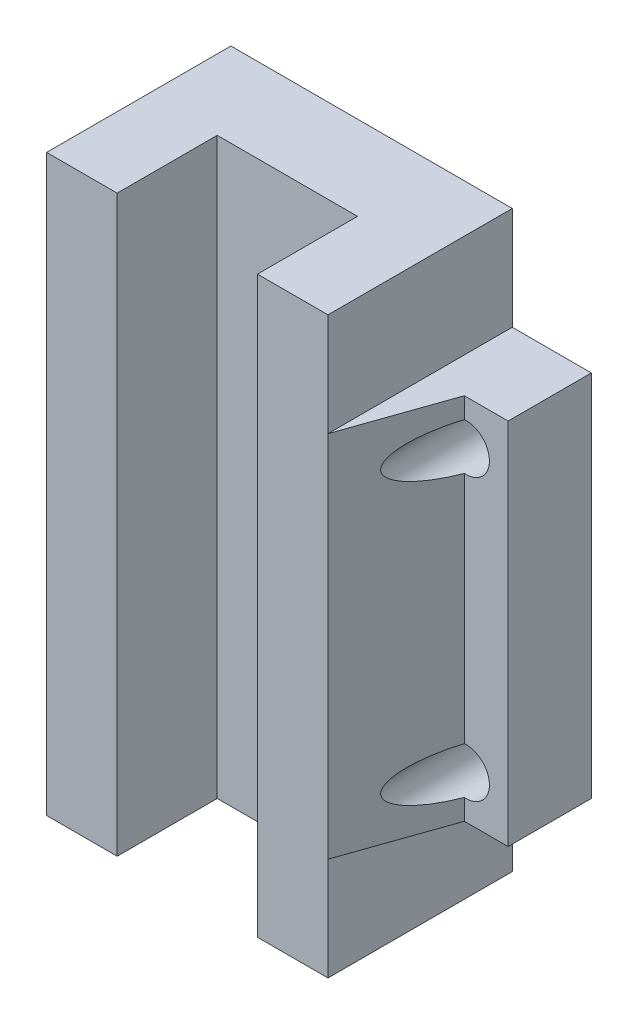
ISO-10303-21;
HEADER;
FILE_DESCRIPTION(('STEP AP214'),'2;1');
FILE_NAME('part.step','',(''),(''),'','','');
FILE_SCHEMA(('AUTOMOTIVE_DESIGN { 1 0 10303 214 1 1 1 1 }'));
ENDSEC;
DATA;
#1=APPLICATION_CONTEXT('core data for automotive mechanical design processes');
#2=APPLICATION_PROTOCOL_DEFINITION('international standard','automotive_design',2000,#1);
#3=PRODUCT_CONTEXT('',#1,'mechanical');
#4=PRODUCT('Part','Part','',(#3));
#5=PRODUCT_RELATED_PRODUCT_CATEGORY('part','',(#4));
#6=PRODUCT_DEFINITION_FORMATION('','',#4);
#7=PRODUCT_DEFINITION_CONTEXT('part definition',#1,'design');
#8=PRODUCT_DEFINITION('design','',#6,#7);
#9=PRODUCT_DEFINITION_SHAPE('','',#8);
#10=(LENGTH_UNIT() NAMED_UNIT(*) SI_UNIT(.MILLI.,.METRE.));
#11=(NAMED_UNIT(*) PLANE_ANGLE_UNIT() SI_UNIT($,.RADIAN.));
#12=(NAMED_UNIT(*) SI_UNIT($,.STERADIAN.) SOLID_ANGLE_UNIT());
#13=UNCERTAINTY_MEASURE_WITH_UNIT(LENGTH_MEASURE(1.E-05),#10,'distance_accuracy_value','');
#14=(GEOMETRIC_REPRESENTATION_CONTEXT(3) GLOBAL_UNCERTAINTY_ASSIGNED_CONTEXT((#13)) GLOBAL_UNIT_ASSIGNED_CONTEXT((#10,
#11,#12)) REPRESENTATION_CONTEXT('',''));
#15=CARTESIAN_POINT('',(0.,0.,0.));
#16=DIRECTION('',(0.,0.,1.));
#17=DIRECTION('',(1.,0.,0.));
#18=AXIS2_PLACEMENT_3D('',#15,#16,#17);
#19=CARTESIAN_POINT('',(23.5,61.4,9.85));
#20=DIRECTION('',(0.,0.,-1.));
#21=DIRECTION('',(-1.,0.,0.));
#22=AXIS2_PLACEMENT_3D('',#19,#20,#21);
#23=PLANE('',#22);
#24=DIRECTION('',(1.,0.,0.));
#25=VECTOR('',#24,1.);
#26=CARTESIAN_POINT('',(23.5,0.,9.85));
#27=LINE('',#26,#25);
#28=CARTESIAN_POINT('',(-15.0406665450277,0.,9.85));
#29=VERTEX_POINT('',#28);
#30=CARTESIAN_POINT('',(-7.5,0.,9.85));
#31=VERTEX_POINT('',#30);
#32=EDGE_CURVE('E350',#29,#31,#27,.T.);
#33=ORIENTED_EDGE('',*,*,#32,.T.);
#34=DIRECTION('',(0.,1.,0.));
#35=VECTOR('',#34,1.);
#36=CARTESIAN_POINT('',(-7.5,61.4,9.85));
#37=LINE('',#36,#35);
#38=CARTESIAN_POINT('',(-7.5,61.4,9.85));
#39=VERTEX_POINT('',#38);
#40=EDGE_CURVE('E48',#31,#39,#37,.T.);
#41=ORIENTED_EDGE('',*,*,#40,.T.);
#42=DIRECTION('',(1.,0.,0.));
#43=VECTOR('',#42,1.);
#44=CARTESIAN_POINT('',(23.5,61.4,9.85));
#45=LINE('',#44,#43);
#46=CARTESIAN_POINT('',(-15.0406665450277,61.4,9.85));
#47=VERTEX_POINT('',#46);
#48=EDGE_CURVE('E342',#47,#39,#45,.T.);
#49=ORIENTED_EDGE('',*,*,#48,.F.);
#50=DIRECTION('',(0.,1.,0.));
#51=VECTOR('',#50,1.);
#52=CARTESIAN_POINT('',(-15.0406665450277,50.4,9.85));
#53=LINE('',#52,#51);
#54=CARTESIAN_POINT('',(-15.0406665450277,50.4,9.85));
#55=VERTEX_POINT('',#54);
#56=EDGE_CURVE('E293',#55,#47,#53,.T.);
#57=ORIENTED_EDGE('',*,*,#56,.F.);
#58=DIRECTION('',(0.,1.,0.));
#59=VECTOR('',#58,1.);
#60=CARTESIAN_POINT('',(-15.0406665450277,0.,9.85));
#61=LINE('',#60,#59);
#62=CARTESIAN_POINT('',(-15.0406665450277,11.,9.85));
#63=VERTEX_POINT('',#62);
#64=EDGE_CURVE('E324',#63,#55,#61,.T.);
#65=ORIENTED_EDGE('',*,*,#64,.F.);
#66=EDGE_CURVE('E320',#29,#63,#61,.T.);
#67=ORIENTED_EDGE('',*,*,#66,.F.);
#68=EDGE_LOOP('',(#33,#41,#49,#57,#65,#67));
#69=FACE_BOUND('',#68,.T.);
#70=ADVANCED_FACE('F40',(#69),#23,.F.);
#71=CARTESIAN_POINT('',(23.5,61.4,-9.85));
#72=DIRECTION('',(0.,0.,1.));
#73=DIRECTION('',(1.,0.,0.));
#74=AXIS2_PLACEMENT_3D('',#71,#72,#73);
#75=PLANE('',#74);
#76=CARTESIAN_POINT('',(19.,45.7,-9.85));
#77=DIRECTION('',(0.,0.,-1.));
#78=DIRECTION('',(-1.,0.,0.));
#79=AXIS2_PLACEMENT_3D('',#76,#77,#78);
#80=CIRCLE('',#79,2.5);
#81=CARTESIAN_POINT('',(16.5,45.7,-9.85));
#82=VERTEX_POINT('',#81);
#83=EDGE_CURVE('E217',#82,#82,#80,.T.);
#84=ORIENTED_EDGE('',*,*,#83,.F.);
#85=EDGE_LOOP('',(#84));
#86=FACE_BOUND('',#85,.T.);
#87=CARTESIAN_POINT('',(19.,15.7,-9.85));
#88=DIRECTION('',(0.,0.,-1.));
#89=DIRECTION('',(-1.,0.,0.));
#90=AXIS2_PLACEMENT_3D('',#87,#88,#89);
#91=CIRCLE('',#90,2.5);
#92=CARTESIAN_POINT('',(16.5,15.7,-9.85));
#93=VERTEX_POINT('',#92);
#94=EDGE_CURVE('E221',#93,#93,#91,.T.);
#95=ORIENTED_EDGE('',*,*,#94,.F.);
#96=EDGE_LOOP('',(#95));
#97=FACE_BOUND('',#96,.T.);
#98=DIRECTION('',(0.,-1.,0.));
#99=VECTOR('',#98,1.);
#100=CARTESIAN_POINT('',(-15.0406665450277,11.,-9.85));
#101=LINE('',#100,#99);
#102=CARTESIAN_POINT('',(-15.0406665450277,11.,-9.85));
#103=VERTEX_POINT('',#102);
#104=CARTESIAN_POINT('',(-15.0406665450277,0.,-9.85));
#105=VERTEX_POINT('',#104);
#106=EDGE_CURVE('E255',#103,#105,#101,.T.);
#107=ORIENTED_EDGE('',*,*,#106,.F.);
#108=DIRECTION('',(-1.,0.,0.));
#109=VECTOR('',#108,1.);
#110=CARTESIAN_POINT('',(0.,11.,-9.85));
#111=LINE('',#110,#109);
#112=CARTESIAN_POINT('',(-23.5,11.,-9.85));
#113=VERTEX_POINT('',#112);
#114=EDGE_CURVE('E250',#103,#113,#111,.T.);
#115=ORIENTED_EDGE('',*,*,#114,.T.);
#116=DIRECTION('',(0.,-1.,0.));
#117=VECTOR('',#116,1.);
#118=CARTESIAN_POINT('',(-23.5,61.4,-9.85));
#119=LINE('',#118,#117);
#120=CARTESIAN_POINT('',(-23.5,50.4,-9.85));
#121=VERTEX_POINT('',#120);
#122=EDGE_CURVE('E349',#121,#113,#119,.T.);
#123=ORIENTED_EDGE('',*,*,#122,.F.);
#124=DIRECTION('',(-1.,0.,0.));
#125=VECTOR('',#124,1.);
#126=CARTESIAN_POINT('',(0.,50.4,-9.85));
#127=LINE('',#126,#125);
#128=CARTESIAN_POINT('',(-15.0406665450277,50.4,-9.85));
#129=VERTEX_POINT('',#128);
#130=EDGE_CURVE('E285',#129,#121,#127,.T.);
#131=ORIENTED_EDGE('',*,*,#130,.F.);
#132=DIRECTION('',(0.,1.,0.));
#133=VECTOR('',#132,1.);
#134=CARTESIAN_POINT('',(-15.0406665450277,50.4,-9.85));
#135=LINE('',#134,#133);
#136=CARTESIAN_POINT('',(-15.0406665450277,61.4,-9.85));
#137=VERTEX_POINT('',#136);
#138=EDGE_CURVE('E296',#129,#137,#135,.T.);
#139=ORIENTED_EDGE('',*,*,#138,.T.);
#140=DIRECTION('',(-1.,0.,0.));
#141=VECTOR('',#140,1.);
#142=CARTESIAN_POINT('',(23.5,61.4,-9.85));
#143=LINE('',#142,#141);
#144=CARTESIAN_POINT('',(15.0406665450277,61.4,-9.85));
#145=VERTEX_POINT('',#144);
#146=EDGE_CURVE('E345',#145,#137,#143,.T.);
#147=ORIENTED_EDGE('',*,*,#146,.F.);
#148=DIRECTION('',(0.,1.,0.));
#149=VECTOR('',#148,1.);
#150=CARTESIAN_POINT('',(15.0406665450277,50.4,-9.85));
#151=LINE('',#150,#149);
#152=CARTESIAN_POINT('',(15.0406665450277,50.4,-9.85));
#153=VERTEX_POINT('',#152);
#154=EDGE_CURVE('E295',#153,#145,#151,.T.);
#155=ORIENTED_EDGE('',*,*,#154,.F.);
#156=DIRECTION('',(-1.,0.,0.));
#157=VECTOR('',#156,1.);
#158=CARTESIAN_POINT('',(0.,50.4,-9.85));
#159=LINE('',#158,#157);
#160=CARTESIAN_POINT('',(23.5,50.4,-9.85));
#161=VERTEX_POINT('',#160);
#162=EDGE_CURVE('E311',#161,#153,#159,.T.);
#163=ORIENTED_EDGE('',*,*,#162,.F.);
#164=DIRECTION('',(0.,-1.,0.));
#165=VECTOR('',#164,1.);
#166=CARTESIAN_POINT('',(23.5,61.4,-9.85));
#167=LINE('',#166,#165);
#168=CARTESIAN_POINT('',(23.5,11.,-9.85));
#169=VERTEX_POINT('',#168);
#170=EDGE_CURVE('E357',#161,#169,#167,.T.);
#171=ORIENTED_EDGE('',*,*,#170,.T.);
#172=DIRECTION('',(-1.,0.,0.));
#173=VECTOR('',#172,1.);
#174=CARTESIAN_POINT('',(0.,11.,-9.85));
#175=LINE('',#174,#173);
#176=CARTESIAN_POINT('',(15.0406665450277,11.,-9.85));
#177=VERTEX_POINT('',#176);
#178=EDGE_CURVE('E264',#169,#177,#175,.T.);
#179=ORIENTED_EDGE('',*,*,#178,.T.);
#180=DIRECTION('',(0.,-1.,0.));
#181=VECTOR('',#180,1.);
#182=CARTESIAN_POINT('',(15.0406665450277,11.,-9.85));
#183=LINE('',#182,#181);
#184=CARTESIAN_POINT('',(15.0406665450277,0.,-9.85));
#185=VERTEX_POINT('',#184);
#186=EDGE_CURVE('E258',#177,#185,#183,.T.);
#187=ORIENTED_EDGE('',*,*,#186,.T.);
#188=DIRECTION('',(-1.,0.,0.));
#189=VECTOR('',#188,1.);
#190=CARTESIAN_POINT('',(23.5,0.,-9.85));
#191=LINE('',#190,#189);
#192=EDGE_CURVE('E352',#185,#105,#191,.T.);
#193=ORIENTED_EDGE('',*,*,#192,.T.);
#194=EDGE_LOOP('',(#107,#115,#123,#131,#139,#147,#155,#163,#171,#179,#187,#193));
#195=FACE_BOUND('',#194,.T.);
#196=CARTESIAN_POINT('',(-19.,15.7,-9.85));
#197=DIRECTION('',(0.,0.,-1.));
#198=DIRECTION('',(-1.,0.,0.));
#199=AXIS2_PLACEMENT_3D('',#196,#197,#198);
#200=CIRCLE('',#199,2.5);
#201=CARTESIAN_POINT('',(-21.5,15.7,-9.85));
#202=VERTEX_POINT('',#201);
#203=EDGE_CURVE('E218',#202,#202,#200,.F.);
#204=ORIENTED_EDGE('',*,*,#203,.T.);
#205=EDGE_LOOP('',(#204));
#206=FACE_BOUND('',#205,.T.);
#207=CARTESIAN_POINT('',(-19.,45.7,-9.85));
#208=DIRECTION('',(0.,0.,-1.));
#209=DIRECTION('',(-1.,0.,0.));
#210=AXIS2_PLACEMENT_3D('',#207,#208,#209);
#211=CIRCLE('',#210,2.50000000000001);
#212=CARTESIAN_POINT('',(-21.5,45.7,-9.85));
#213=VERTEX_POINT('',#212);
#214=EDGE_CURVE('E222',#213,#213,#211,.F.);
#215=ORIENTED_EDGE('',*,*,#214,.T.);
#216=EDGE_LOOP('',(#215));
#217=FACE_BOUND('',#216,.T.);
#218=ADVANCED_FACE('F386',(#86,#97,#195,#206,#217),#75,.F.);
#219=CARTESIAN_POINT('',(-23.5,61.4,9.85));
#220=DIRECTION('',(1.,0.,0.));
#221=DIRECTION('',(0.,0.,-1.));
#222=AXIS2_PLACEMENT_3D('',#219,#220,#221);
#223=PLANE('',#222);
#224=DIRECTION('',(0.,0.,1.));
#225=VECTOR('',#224,1.);
#226=CARTESIAN_POINT('',(-23.5,11.,0.));
#227=LINE('',#226,#225);
#228=CARTESIAN_POINT('',(-23.5,11.,-0.949999999999996));
#229=VERTEX_POINT('',#228);
#230=EDGE_CURVE('E247',#113,#229,#227,.T.);
#231=ORIENTED_EDGE('',*,*,#230,.T.);
#232=DIRECTION('',(0.,1.,0.));
#233=VECTOR('',#232,1.);
#234=CARTESIAN_POINT('',(-23.5,0.,-0.949999999999996));
#235=LINE('',#234,#233);
#236=CARTESIAN_POINT('',(-23.5,50.4,-0.949999999999996));
#237=VERTEX_POINT('',#236);
#238=EDGE_CURVE('E325',#229,#237,#235,.T.);
#239=ORIENTED_EDGE('',*,*,#238,.T.);
#240=DIRECTION('',(0.,0.,1.));
#241=VECTOR('',#240,1.);
#242=CARTESIAN_POINT('',(-23.5,50.4,0.));
#243=LINE('',#242,#241);
#244=EDGE_CURVE('E287',#121,#237,#243,.T.);
#245=ORIENTED_EDGE('',*,*,#244,.F.);
#246=ORIENTED_EDGE('',*,*,#122,.T.);
#247=EDGE_LOOP('',(#231,#239,#245,#246));
#248=FACE_BOUND('',#247,.T.);
#249=ADVANCED_FACE('F42',(#248),#223,.F.);
#250=CARTESIAN_POINT('',(23.5,61.4,9.85));
#251=DIRECTION('',(-1.,0.,0.));
#252=DIRECTION('',(0.,0.,1.));
#253=AXIS2_PLACEMENT_3D('',#250,#251,#252);
#254=PLANE('',#253);
#255=DIRECTION('',(0.,0.,-1.));
#256=VECTOR('',#255,1.);
#257=CARTESIAN_POINT('',(23.5,11.,0.));
#258=LINE('',#257,#256);
#259=CARTESIAN_POINT('',(23.5,11.,-0.950000000000001));
#260=VERTEX_POINT('',#259);
#261=EDGE_CURVE('E267',#260,#169,#258,.T.);
#262=ORIENTED_EDGE('',*,*,#261,.T.);
#263=ORIENTED_EDGE('',*,*,#170,.F.);
#264=DIRECTION('',(0.,0.,-1.));
#265=VECTOR('',#264,1.);
#266=CARTESIAN_POINT('',(23.5,50.4,0.));
#267=LINE('',#266,#265);
#268=CARTESIAN_POINT('',(23.5,50.4,-0.950000000000001));
#269=VERTEX_POINT('',#268);
#270=EDGE_CURVE('E309',#269,#161,#267,.T.);
#271=ORIENTED_EDGE('',*,*,#270,.F.);
#272=DIRECTION('',(0.,1.,0.));
#273=VECTOR('',#272,1.);
#274=CARTESIAN_POINT('',(23.5,0.,-0.950000000000001));
#275=LINE('',#274,#273);
#276=EDGE_CURVE('E299',#260,#269,#275,.T.);
#277=ORIENTED_EDGE('',*,*,#276,.F.);
#278=EDGE_LOOP('',(#262,#263,#271,#277));
#279=FACE_BOUND('',#278,.T.);
#280=ADVANCED_FACE('F436',(#279),#254,.F.);
#281=CARTESIAN_POINT('',(16.4706870117693,0.,5.76297701154337));
#282=DIRECTION('',(-0.943889862378545,0.,-0.330260393778926));
#283=DIRECTION('',(-0.330260393778926,0.,0.943889862378545));
#284=AXIS2_PLACEMENT_3D('',#281,#282,#283);
#285=PLANE('',#284);
#286=DIRECTION('',(0.,1.,0.));
#287=VECTOR('',#286,1.);
#288=CARTESIAN_POINT('',(18.8195102374732,0.,-0.950000000000001));
#289=LINE('',#288,#287);
#290=CARTESIAN_POINT('',(18.8195102374732,18.1934761770715,-0.95));
#291=VERTEX_POINT('',#290);
#292=CARTESIAN_POINT('',(18.8195102374732,43.2065238229285,-0.95));
#293=VERTEX_POINT('',#292);
#294=EDGE_CURVE('E339',#291,#293,#289,.T.);
#295=ORIENTED_EDGE('',*,*,#294,.T.);
#296=CARTESIAN_POINT('',(19.,45.7,-1.46584283287132));
#297=DIRECTION('',(-0.943889862378545,0.,-0.330260393778926));
#298=DIRECTION('',(0.330260393778926,0.,-0.943889862378545));
#299=AXIS2_PLACEMENT_3D('',#296,#297,#298);
#300=ELLIPSE('',#299,7.56978447035183,2.5);
#301=CARTESIAN_POINT('',(18.8195102374732,48.1934761770715,-0.95));
#302=VERTEX_POINT('',#301);
#303=EDGE_CURVE('E62',#293,#302,#300,.T.);
#304=ORIENTED_EDGE('',*,*,#303,.T.);
#305=CARTESIAN_POINT('',(18.8195102374732,50.4,-0.950000000000001));
#306=VERTEX_POINT('',#305);
#307=EDGE_CURVE('E340',#302,#306,#289,.T.);
#308=ORIENTED_EDGE('',*,*,#307,.T.);
#309=DIRECTION('',(-0.330260393778926,0.,0.943889862378545));
#310=VECTOR('',#309,1.);
#311=CARTESIAN_POINT('',(16.4706870117693,50.4,5.76297701154337));
#312=LINE('',#311,#310);
#313=CARTESIAN_POINT('',(15.0406665450277,50.4,9.85));
#314=VERTEX_POINT('',#313);
#315=EDGE_CURVE('E303',#306,#314,#312,.T.);
#316=ORIENTED_EDGE('',*,*,#315,.T.);
#317=DIRECTION('',(0.,1.,0.));
#318=VECTOR('',#317,1.);
#319=CARTESIAN_POINT('',(15.0406665450277,0.,9.85));
#320=LINE('',#319,#318);
#321=CARTESIAN_POINT('',(15.0406665450277,11.,9.85));
#322=VERTEX_POINT('',#321);
#323=EDGE_CURVE('E335',#322,#314,#320,.T.);
#324=ORIENTED_EDGE('',*,*,#323,.F.);
#325=DIRECTION('',(-0.330260393778926,0.,0.943889862378545));
#326=VECTOR('',#325,1.);
#327=CARTESIAN_POINT('',(16.4706870117693,11.,5.76297701154337));
#328=LINE('',#327,#326);
#329=CARTESIAN_POINT('',(18.8195102374732,11.,-0.950000000000001));
#330=VERTEX_POINT('',#329);
#331=EDGE_CURVE('E272',#330,#322,#328,.T.);
#332=ORIENTED_EDGE('',*,*,#331,.F.);
#333=CARTESIAN_POINT('',(18.8195102374732,13.2065238229285,-0.95));
#334=VERTEX_POINT('',#333);
#335=EDGE_CURVE('E336',#330,#334,#289,.T.);
#336=ORIENTED_EDGE('',*,*,#335,.T.);
#337=CARTESIAN_POINT('',(19.,15.7,-1.46584283287132));
#338=DIRECTION('',(-0.943889862378545,0.,-0.330260393778926));
#339=DIRECTION('',(0.330260393778926,0.,-0.943889862378545));
#340=AXIS2_PLACEMENT_3D('',#337,#338,#339);
#341=ELLIPSE('',#340,7.56978447035183,2.5);
#342=EDGE_CURVE('E235',#334,#291,#341,.T.);
#343=ORIENTED_EDGE('',*,*,#342,.T.);
#344=EDGE_LOOP('',(#295,#304,#308,#316,#324,#332,#336,#343));
#345=FACE_BOUND('',#344,.T.);
#346=ADVANCED_FACE('F419',(#345),#285,.F.);
#347=CARTESIAN_POINT('',(0.,0.,-0.949999999999997));
#348=DIRECTION('',(0.,0.,-1.));
#349=DIRECTION('',(-1.,0.,0.));
#350=AXIS2_PLACEMENT_3D('',#347,#348,#349);
#351=PLANE('',#350);
#352=ORIENTED_EDGE('',*,*,#307,.F.);
#353=CARTESIAN_POINT('',(19.,45.7,-0.95));
#354=DIRECTION('',(0.,0.,-1.));
#355=DIRECTION('',(-1.,0.,0.));
#356=AXIS2_PLACEMENT_3D('',#353,#354,#355);
#357=CIRCLE('',#356,2.5);
#358=EDGE_CURVE('E369',#302,#293,#357,.T.);
#359=ORIENTED_EDGE('',*,*,#358,.T.);
#360=ORIENTED_EDGE('',*,*,#294,.F.);
#361=CARTESIAN_POINT('',(19.,15.7,-0.95));
#362=DIRECTION('',(0.,0.,-1.));
#363=DIRECTION('',(-1.,0.,0.));
#364=AXIS2_PLACEMENT_3D('',#361,#362,#363);
#365=CIRCLE('',#364,2.5);
#366=EDGE_CURVE('E366',#291,#334,#365,.T.);
#367=ORIENTED_EDGE('',*,*,#366,.T.);
#368=ORIENTED_EDGE('',*,*,#335,.F.);
#369=DIRECTION('',(-1.,0.,0.));
#370=VECTOR('',#369,1.);
#371=CARTESIAN_POINT('',(0.,11.,-0.949999999999997));
#372=LINE('',#371,#370);
#373=EDGE_CURVE('E270',#260,#330,#372,.T.);
#374=ORIENTED_EDGE('',*,*,#373,.F.);
#375=ORIENTED_EDGE('',*,*,#276,.T.);
#376=DIRECTION('',(-1.,0.,0.));
#377=VECTOR('',#376,1.);
#378=CARTESIAN_POINT('',(0.,50.4,-0.949999999999997));
#379=LINE('',#378,#377);
#380=EDGE_CURVE('E306',#269,#306,#379,.T.);
#381=ORIENTED_EDGE('',*,*,#380,.T.);
#382=EDGE_LOOP('',(#352,#359,#360,#367,#368,#374,#375,#381));
#383=FACE_BOUND('',#382,.T.);
#384=ADVANCED_FACE('F440',(#383),#351,.F.);
#385=CARTESIAN_POINT('',(-16.4706870117693,0.,5.76297701154337));
#386=DIRECTION('',(-0.943889862378545,0.,0.330260393778927));
#387=DIRECTION('',(0.330260393778927,0.,0.943889862378545));
#388=AXIS2_PLACEMENT_3D('',#385,#386,#387);
#389=PLANE('',#388);
#390=DIRECTION('',(0.,1.,0.));
#391=VECTOR('',#390,1.);
#392=CARTESIAN_POINT('',(-18.8195102374732,0.,-0.949999999999996));
#393=LINE('',#392,#391);
#394=CARTESIAN_POINT('',(-18.8195102374732,48.1934761770715,-0.949999999999996));
#395=VERTEX_POINT('',#394);
#396=CARTESIAN_POINT('',(-18.8195102374732,50.4,-0.949999999999996));
#397=VERTEX_POINT('',#396);
#398=EDGE_CURVE('E331',#395,#397,#393,.T.);
#399=ORIENTED_EDGE('',*,*,#398,.F.);
#400=CARTESIAN_POINT('',(-19.,45.7,-1.46584283287134));
#401=DIRECTION('',(-0.943889862378545,0.,0.330260393778927));
#402=DIRECTION('',(-0.330260393778927,0.,-0.943889862378545));
#403=AXIS2_PLACEMENT_3D('',#400,#401,#402);
#404=ELLIPSE('',#403,7.56978447035185,2.50000000000001);
#405=CARTESIAN_POINT('',(-18.8195102374732,43.2065238229285,-0.949999999999996));
#406=VERTEX_POINT('',#405);
#407=EDGE_CURVE('E232',#395,#406,#404,.F.);
#408=ORIENTED_EDGE('',*,*,#407,.T.);
#409=CARTESIAN_POINT('',(-18.8195102374732,18.1934761770715,-0.949999999999996));
#410=VERTEX_POINT('',#409);
#411=EDGE_CURVE('E330',#410,#406,#393,.T.);
#412=ORIENTED_EDGE('',*,*,#411,.F.);
#413=CARTESIAN_POINT('',(-19.,15.7,-1.46584283287134));
#414=DIRECTION('',(-0.943889862378545,0.,0.330260393778927));
#415=DIRECTION('',(-0.330260393778927,0.,-0.943889862378545));
#416=AXIS2_PLACEMENT_3D('',#413,#414,#415);
#417=ELLIPSE('',#416,7.56978447035184,2.5);
#418=CARTESIAN_POINT('',(-18.8195102374732,13.2065238229285,-0.949999999999996));
#419=VERTEX_POINT('',#418);
#420=EDGE_CURVE('E229',#410,#419,#417,.F.);
#421=ORIENTED_EDGE('',*,*,#420,.T.);
#422=CARTESIAN_POINT('',(-18.8195102374732,11.,-0.949999999999996));
#423=VERTEX_POINT('',#422);
#424=EDGE_CURVE('E327',#423,#419,#393,.T.);
#425=ORIENTED_EDGE('',*,*,#424,.F.);
#426=DIRECTION('',(0.330260393778927,0.,0.943889862378545));
#427=VECTOR('',#426,1.);
#428=CARTESIAN_POINT('',(-16.4706870117693,11.,5.76297701154337));
#429=LINE('',#428,#427);
#430=EDGE_CURVE('E240',#423,#63,#429,.T.);
#431=ORIENTED_EDGE('',*,*,#430,.T.);
#432=ORIENTED_EDGE('',*,*,#64,.T.);
#433=DIRECTION('',(0.330260393778927,0.,0.943889862378545));
#434=VECTOR('',#433,1.);
#435=CARTESIAN_POINT('',(-16.4706870117693,50.4,5.76297701154337));
#436=LINE('',#435,#434);
#437=EDGE_CURVE('E278',#397,#55,#436,.T.);
#438=ORIENTED_EDGE('',*,*,#437,.F.);
#439=EDGE_LOOP('',(#399,#408,#412,#421,#425,#431,#432,#438));
#440=FACE_BOUND('',#439,.T.);
#441=ADVANCED_FACE('F403',(#440),#389,.T.);
#442=CARTESIAN_POINT('',(0.,0.,-0.949999999999996));
#443=DIRECTION('',(0.,0.,1.));
#444=DIRECTION('',(1.,0.,0.));
#445=AXIS2_PLACEMENT_3D('',#442,#443,#444);
#446=PLANE('',#445);
#447=ORIENTED_EDGE('',*,*,#411,.T.);
#448=CARTESIAN_POINT('',(-19.,45.7,-0.949999999999996));
#449=DIRECTION('',(0.,0.,1.));
#450=DIRECTION('',(1.,0.,0.));
#451=AXIS2_PLACEMENT_3D('',#448,#449,#450);
#452=CIRCLE('',#451,2.50000000000001);
#453=EDGE_CURVE('E363',#406,#395,#452,.F.);
#454=ORIENTED_EDGE('',*,*,#453,.T.);
#455=ORIENTED_EDGE('',*,*,#398,.T.);
#456=DIRECTION('',(1.,0.,0.));
#457=VECTOR('',#456,1.);
#458=CARTESIAN_POINT('',(0.,50.4,-0.949999999999996));
#459=LINE('',#458,#457);
#460=EDGE_CURVE('E290',#237,#397,#459,.T.);
#461=ORIENTED_EDGE('',*,*,#460,.F.);
#462=ORIENTED_EDGE('',*,*,#238,.F.);
#463=DIRECTION('',(1.,0.,0.));
#464=VECTOR('',#463,1.);
#465=CARTESIAN_POINT('',(0.,11.,-0.949999999999996));
#466=LINE('',#465,#464);
#467=EDGE_CURVE('E243',#229,#423,#466,.T.);
#468=ORIENTED_EDGE('',*,*,#467,.T.);
#469=ORIENTED_EDGE('',*,*,#424,.T.);
#470=CARTESIAN_POINT('',(-19.,15.7,-0.949999999999996));
#471=DIRECTION('',(0.,0.,1.));
#472=DIRECTION('',(1.,0.,0.));
#473=AXIS2_PLACEMENT_3D('',#470,#471,#472);
#474=CIRCLE('',#473,2.5);
#475=EDGE_CURVE('E360',#419,#410,#474,.F.);
#476=ORIENTED_EDGE('',*,*,#475,.T.);
#477=EDGE_LOOP('',(#447,#454,#455,#461,#462,#468,#469,#476));
#478=FACE_BOUND('',#477,.T.);
#479=ADVANCED_FACE('F398',(#478),#446,.T.);
#480=CARTESIAN_POINT('',(0.,0.,0.));
#481=DIRECTION('',(0.,1.,0.));
#482=DIRECTION('',(0.,0.,1.));
#483=AXIS2_PLACEMENT_3D('',#480,#481,#482);
#484=PLANE('',#483);
#485=DIRECTION('',(1.,0.,0.));
#486=VECTOR('',#485,1.);
#487=CARTESIAN_POINT('',(7.5,0.,-0.849999999999995));
#488=LINE('',#487,#486);
#489=CARTESIAN_POINT('',(-7.5,0.,-0.849999999999997));
#490=VERTEX_POINT('',#489);
#491=CARTESIAN_POINT('',(7.5,0.,-0.849999999999995));
#492=VERTEX_POINT('',#491);
#493=EDGE_CURVE('E193',#490,#492,#488,.T.);
#494=ORIENTED_EDGE('',*,*,#493,.F.);
#495=DIRECTION('',(0.,0.,-1.));
#496=VECTOR('',#495,1.);
#497=CARTESIAN_POINT('',(-7.5,0.,-0.849999999999997));
#498=LINE('',#497,#496);
#499=EDGE_CURVE('E200',#31,#490,#498,.T.);
#500=ORIENTED_EDGE('',*,*,#499,.F.);
#501=ORIENTED_EDGE('',*,*,#32,.F.);
#502=DIRECTION('',(0.,0.,-1.));
#503=VECTOR('',#502,1.);
#504=CARTESIAN_POINT('',(-15.0406665450277,0.,0.));
#505=LINE('',#504,#503);
#506=EDGE_CURVE('E244',#29,#105,#505,.T.);
#507=ORIENTED_EDGE('',*,*,#506,.T.);
#508=ORIENTED_EDGE('',*,*,#192,.F.);
#509=DIRECTION('',(0.,0.,-1.));
#510=VECTOR('',#509,1.);
#511=CARTESIAN_POINT('',(15.0406665450277,0.,0.));
#512=LINE('',#511,#510);
#513=CARTESIAN_POINT('',(15.0406665450277,0.,9.85));
#514=VERTEX_POINT('',#513);
#515=EDGE_CURVE('E239',#514,#185,#512,.T.);
#516=ORIENTED_EDGE('',*,*,#515,.F.);
#517=CARTESIAN_POINT('',(7.5,0.,9.85));
#518=VERTEX_POINT('',#517);
#519=EDGE_CURVE('E323',#518,#514,#27,.T.);
#520=ORIENTED_EDGE('',*,*,#519,.F.);
#521=DIRECTION('',(0.,0.,1.));
#522=VECTOR('',#521,1.);
#523=CARTESIAN_POINT('',(7.5,0.,-0.849999999999995));
#524=LINE('',#523,#522);
#525=EDGE_CURVE('E55',#492,#518,#524,.T.);
#526=ORIENTED_EDGE('',*,*,#525,.F.);
#527=EDGE_LOOP('',(#494,#500,#501,#507,#508,#516,#520,#526));
#528=FACE_BOUND('',#527,.T.);
#529=ADVANCED_FACE('F207',(#528),#484,.F.);
#530=CARTESIAN_POINT('',(0.,61.4,0.));
#531=DIRECTION('',(0.,1.,0.));
#532=DIRECTION('',(0.,0.,1.));
#533=AXIS2_PLACEMENT_3D('',#530,#531,#532);
#534=PLANE('',#533);
#535=DIRECTION('',(0.,0.,1.));
#536=VECTOR('',#535,1.);
#537=CARTESIAN_POINT('',(-7.5,61.4,0.));
#538=LINE('',#537,#536);
#539=CARTESIAN_POINT('',(-7.5,61.4,-0.849999999999997));
#540=VERTEX_POINT('',#539);
#541=EDGE_CURVE('E215',#540,#39,#538,.T.);
#542=ORIENTED_EDGE('',*,*,#541,.F.);
#543=DIRECTION('',(-1.,0.,0.));
#544=VECTOR('',#543,1.);
#545=CARTESIAN_POINT('',(0.,61.4,-0.849999999999996));
#546=LINE('',#545,#544);
#547=CARTESIAN_POINT('',(7.5,61.4,-0.849999999999995));
#548=VERTEX_POINT('',#547);
#549=EDGE_CURVE('E11',#548,#540,#546,.T.);
#550=ORIENTED_EDGE('',*,*,#549,.F.);
#551=DIRECTION('',(0.,0.,-1.));
#552=VECTOR('',#551,1.);
#553=CARTESIAN_POINT('',(7.5,61.4,0.));
#554=LINE('',#553,#552);
#555=CARTESIAN_POINT('',(7.5,61.4,9.85));
#556=VERTEX_POINT('',#555);
#557=EDGE_CURVE('E212',#556,#548,#554,.T.);
#558=ORIENTED_EDGE('',*,*,#557,.F.);
#559=CARTESIAN_POINT('',(15.0406665450277,61.4,9.85));
#560=VERTEX_POINT('',#559);
#561=EDGE_CURVE('E346',#556,#560,#45,.T.);
#562=ORIENTED_EDGE('',*,*,#561,.T.);
#563=DIRECTION('',(0.,0.,-1.));
#564=VECTOR('',#563,1.);
#565=CARTESIAN_POINT('',(15.0406665450277,61.4,0.));
#566=LINE('',#565,#564);
#567=EDGE_CURVE('E260',#560,#145,#566,.T.);
#568=ORIENTED_EDGE('',*,*,#567,.T.);
#569=ORIENTED_EDGE('',*,*,#146,.T.);
#570=DIRECTION('',(0.,0.,-1.));
#571=VECTOR('',#570,1.);
#572=CARTESIAN_POINT('',(-15.0406665450277,61.4,0.));
#573=LINE('',#572,#571);
#574=EDGE_CURVE('E282',#47,#137,#573,.T.);
#575=ORIENTED_EDGE('',*,*,#574,.F.);
#576=ORIENTED_EDGE('',*,*,#48,.T.);
#577=EDGE_LOOP('',(#542,#550,#558,#562,#568,#569,#575,#576));
#578=FACE_BOUND('',#577,.T.);
#579=ADVANCED_FACE('F378',(#578),#534,.T.);
#580=ORIENTED_EDGE('',*,*,#561,.F.);
#581=DIRECTION('',(0.,-1.,0.));
#582=VECTOR('',#581,1.);
#583=CARTESIAN_POINT('',(7.5,61.4,9.85));
#584=LINE('',#583,#582);
#585=EDGE_CURVE('E371',#556,#518,#584,.T.);
#586=ORIENTED_EDGE('',*,*,#585,.T.);
#587=ORIENTED_EDGE('',*,*,#519,.T.);
#588=EDGE_CURVE('E332',#514,#322,#320,.T.);
#589=ORIENTED_EDGE('',*,*,#588,.T.);
#590=ORIENTED_EDGE('',*,*,#323,.T.);
#591=DIRECTION('',(0.,1.,0.));
#592=VECTOR('',#591,1.);
#593=CARTESIAN_POINT('',(15.0406665450277,50.4,9.85));
#594=LINE('',#593,#592);
#595=EDGE_CURVE('E314',#314,#560,#594,.T.);
#596=ORIENTED_EDGE('',*,*,#595,.T.);
#597=EDGE_LOOP('',(#580,#586,#587,#589,#590,#596));
#598=FACE_BOUND('',#597,.T.);
#599=ADVANCED_FACE('F424',(#598),#23,.F.);
#600=CARTESIAN_POINT('',(-15.0406665450277,50.4,0.));
#601=DIRECTION('',(1.,0.,0.));
#602=DIRECTION('',(0.,0.,-1.));
#603=AXIS2_PLACEMENT_3D('',#600,#601,#602);
#604=PLANE('',#603);
#605=ORIENTED_EDGE('',*,*,#574,.T.);
#606=ORIENTED_EDGE('',*,*,#138,.F.);
#607=DIRECTION('',(0.,0.,-1.));
#608=VECTOR('',#607,1.);
#609=CARTESIAN_POINT('',(-15.0406665450277,50.4,0.));
#610=LINE('',#609,#608);
#611=EDGE_CURVE('E281',#55,#129,#610,.T.);
#612=ORIENTED_EDGE('',*,*,#611,.F.);
#613=ORIENTED_EDGE('',*,*,#56,.T.);
#614=EDGE_LOOP('',(#605,#606,#612,#613));
#615=FACE_BOUND('',#614,.T.);
#616=ADVANCED_FACE('F381',(#615),#604,.F.);
#617=CARTESIAN_POINT('',(0.,50.4,0.));
#618=DIRECTION('',(0.,1.,0.));
#619=DIRECTION('',(0.,0.,1.));
#620=AXIS2_PLACEMENT_3D('',#617,#618,#619);
#621=PLANE('',#620);
#622=ORIENTED_EDGE('',*,*,#437,.T.);
#623=ORIENTED_EDGE('',*,*,#611,.T.);
#624=ORIENTED_EDGE('',*,*,#130,.T.);
#625=ORIENTED_EDGE('',*,*,#244,.T.);
#626=ORIENTED_EDGE('',*,*,#460,.T.);
#627=EDGE_LOOP('',(#622,#623,#624,#625,#626));
#628=FACE_BOUND('',#627,.T.);
#629=ADVANCED_FACE('F392',(#628),#621,.T.);
#630=CARTESIAN_POINT('',(15.0406665450277,50.4,0.));
#631=DIRECTION('',(1.,0.,0.));
#632=DIRECTION('',(0.,0.,-1.));
#633=AXIS2_PLACEMENT_3D('',#630,#631,#632);
#634=PLANE('',#633);
#635=ORIENTED_EDGE('',*,*,#567,.F.);
#636=ORIENTED_EDGE('',*,*,#595,.F.);
#637=DIRECTION('',(0.,0.,-1.));
#638=VECTOR('',#637,1.);
#639=CARTESIAN_POINT('',(15.0406665450277,50.4,0.));
#640=LINE('',#639,#638);
#641=EDGE_CURVE('E301',#314,#153,#640,.T.);
#642=ORIENTED_EDGE('',*,*,#641,.T.);
#643=ORIENTED_EDGE('',*,*,#154,.T.);
#644=EDGE_LOOP('',(#635,#636,#642,#643));
#645=FACE_BOUND('',#644,.T.);
#646=ADVANCED_FACE('F429',(#645),#634,.T.);
#647=CARTESIAN_POINT('',(0.,50.4,0.));
#648=DIRECTION('',(0.,1.,0.));
#649=DIRECTION('',(0.,0.,1.));
#650=AXIS2_PLACEMENT_3D('',#647,#648,#649);
#651=PLANE('',#650);
#652=ORIENTED_EDGE('',*,*,#641,.F.);
#653=ORIENTED_EDGE('',*,*,#315,.F.);
#654=ORIENTED_EDGE('',*,*,#380,.F.);
#655=ORIENTED_EDGE('',*,*,#270,.T.);
#656=ORIENTED_EDGE('',*,*,#162,.T.);
#657=EDGE_LOOP('',(#652,#653,#654,#655,#656));
#658=FACE_BOUND('',#657,.T.);
#659=ADVANCED_FACE('F444',(#658),#651,.T.);
#660=CARTESIAN_POINT('',(15.0406665450277,11.,0.));
#661=DIRECTION('',(-1.,0.,0.));
#662=DIRECTION('',(0.,0.,1.));
#663=AXIS2_PLACEMENT_3D('',#660,#661,#662);
#664=PLANE('',#663);
#665=ORIENTED_EDGE('',*,*,#515,.T.);
#666=ORIENTED_EDGE('',*,*,#186,.F.);
#667=DIRECTION('',(0.,0.,-1.));
#668=VECTOR('',#667,1.);
#669=CARTESIAN_POINT('',(15.0406665450277,11.,0.));
#670=LINE('',#669,#668);
#671=EDGE_CURVE('E261',#322,#177,#670,.T.);
#672=ORIENTED_EDGE('',*,*,#671,.F.);
#673=ORIENTED_EDGE('',*,*,#588,.F.);
#674=EDGE_LOOP('',(#665,#666,#672,#673));
#675=FACE_BOUND('',#674,.T.);
#676=ADVANCED_FACE('F409',(#675),#664,.F.);
#677=CARTESIAN_POINT('',(0.,11.,0.));
#678=DIRECTION('',(0.,-1.,0.));
#679=DIRECTION('',(0.,0.,1.));
#680=AXIS2_PLACEMENT_3D('',#677,#678,#679);
#681=PLANE('',#680);
#682=ORIENTED_EDGE('',*,*,#671,.T.);
#683=ORIENTED_EDGE('',*,*,#178,.F.);
#684=ORIENTED_EDGE('',*,*,#261,.F.);
#685=ORIENTED_EDGE('',*,*,#373,.T.);
#686=ORIENTED_EDGE('',*,*,#331,.T.);
#687=EDGE_LOOP('',(#682,#683,#684,#685,#686));
#688=FACE_BOUND('',#687,.T.);
#689=ADVANCED_FACE('F412',(#688),#681,.T.);
#690=CARTESIAN_POINT('',(-15.0406665450277,11.,0.));
#691=DIRECTION('',(-1.,0.,0.));
#692=DIRECTION('',(0.,0.,1.));
#693=AXIS2_PLACEMENT_3D('',#690,#691,#692);
#694=PLANE('',#693);
#695=ORIENTED_EDGE('',*,*,#506,.F.);
#696=ORIENTED_EDGE('',*,*,#66,.T.);
#697=DIRECTION('',(0.,0.,-1.));
#698=VECTOR('',#697,1.);
#699=CARTESIAN_POINT('',(-15.0406665450277,11.,0.));
#700=LINE('',#699,#698);
#701=EDGE_CURVE('E253',#63,#103,#700,.T.);
#702=ORIENTED_EDGE('',*,*,#701,.T.);
#703=ORIENTED_EDGE('',*,*,#106,.T.);
#704=EDGE_LOOP('',(#695,#696,#702,#703));
#705=FACE_BOUND('',#704,.T.);
#706=ADVANCED_FACE('F635',(#705),#694,.T.);
#707=CARTESIAN_POINT('',(0.,11.,0.));
#708=DIRECTION('',(0.,-1.,0.));
#709=DIRECTION('',(0.,0.,1.));
#710=AXIS2_PLACEMENT_3D('',#707,#708,#709);
#711=PLANE('',#710);
#712=ORIENTED_EDGE('',*,*,#430,.F.);
#713=ORIENTED_EDGE('',*,*,#467,.F.);
#714=ORIENTED_EDGE('',*,*,#230,.F.);
#715=ORIENTED_EDGE('',*,*,#114,.F.);
#716=ORIENTED_EDGE('',*,*,#701,.F.);
#717=EDGE_LOOP('',(#712,#713,#714,#715,#716));
#718=FACE_BOUND('',#717,.T.);
#719=ADVANCED_FACE('F493',(#718),#711,.T.);
#720=CARTESIAN_POINT('',(-19.,15.7,23.15));
#721=DIRECTION('',(0.,0.,-1.));
#722=DIRECTION('',(-1.,0.,0.));
#723=AXIS2_PLACEMENT_3D('',#720,#721,#722);
#724=CYLINDRICAL_SURFACE('',#723,2.5);
#725=ORIENTED_EDGE('',*,*,#475,.F.);
#726=ORIENTED_EDGE('',*,*,#420,.F.);
#727=EDGE_LOOP('',(#725,#726));
#728=FACE_BOUND('',#727,.T.);
#729=ORIENTED_EDGE('',*,*,#203,.F.);
#730=EDGE_LOOP('',(#729));
#731=FACE_BOUND('',#730,.T.);
#732=ADVANCED_FACE('F532',(#728,#731),#724,.F.);
#733=CARTESIAN_POINT('',(-19.,45.7,23.15));
#734=DIRECTION('',(0.,0.,-1.));
#735=DIRECTION('',(-1.,0.,0.));
#736=AXIS2_PLACEMENT_3D('',#733,#734,#735);
#737=CYLINDRICAL_SURFACE('',#736,2.50000000000001);
#738=ORIENTED_EDGE('',*,*,#453,.F.);
#739=ORIENTED_EDGE('',*,*,#407,.F.);
#740=EDGE_LOOP('',(#738,#739));
#741=FACE_BOUND('',#740,.T.);
#742=ORIENTED_EDGE('',*,*,#214,.F.);
#743=EDGE_LOOP('',(#742));
#744=FACE_BOUND('',#743,.T.);
#745=ADVANCED_FACE('F536',(#741,#744),#737,.F.);
#746=CARTESIAN_POINT('',(19.,15.7,23.15));
#747=DIRECTION('',(0.,0.,-1.));
#748=DIRECTION('',(-1.,0.,0.));
#749=AXIS2_PLACEMENT_3D('',#746,#747,#748);
#750=CYLINDRICAL_SURFACE('',#749,2.5);
#751=ORIENTED_EDGE('',*,*,#94,.T.);
#752=EDGE_LOOP('',(#751));
#753=FACE_BOUND('',#752,.T.);
#754=ORIENTED_EDGE('',*,*,#366,.F.);
#755=ORIENTED_EDGE('',*,*,#342,.F.);
#756=EDGE_LOOP('',(#754,#755));
#757=FACE_BOUND('',#756,.T.);
#758=ADVANCED_FACE('F547',(#753,#757),#750,.F.);
#759=CARTESIAN_POINT('',(19.,45.7,23.15));
#760=DIRECTION('',(0.,0.,-1.));
#761=DIRECTION('',(-1.,0.,0.));
#762=AXIS2_PLACEMENT_3D('',#759,#760,#761);
#763=CYLINDRICAL_SURFACE('',#762,2.5);
#764=ORIENTED_EDGE('',*,*,#83,.T.);
#765=EDGE_LOOP('',(#764));
#766=FACE_BOUND('',#765,.T.);
#767=ORIENTED_EDGE('',*,*,#358,.F.);
#768=ORIENTED_EDGE('',*,*,#303,.F.);
#769=EDGE_LOOP('',(#767,#768));
#770=FACE_BOUND('',#769,.T.);
#771=ADVANCED_FACE('F558',(#766,#770),#763,.F.);
#772=CARTESIAN_POINT('',(-7.5,73.,-0.849999999999997));
#773=DIRECTION('',(-1.,0.,0.));
#774=DIRECTION('',(0.,0.,1.));
#775=AXIS2_PLACEMENT_3D('',#772,#773,#774);
#776=PLANE('',#775);
#777=ORIENTED_EDGE('',*,*,#541,.T.);
#778=ORIENTED_EDGE('',*,*,#40,.F.);
#779=ORIENTED_EDGE('',*,*,#499,.T.);
#780=DIRECTION('',(0.,-1.,0.));
#781=VECTOR('',#780,1.);
#782=CARTESIAN_POINT('',(-7.5,73.,-0.849999999999997));
#783=LINE('',#782,#781);
#784=EDGE_CURVE('E188',#540,#490,#783,.T.);
#785=ORIENTED_EDGE('',*,*,#784,.F.);
#786=EDGE_LOOP('',(#777,#778,#779,#785));
#787=FACE_BOUND('',#786,.T.);
#788=ADVANCED_FACE('F201',(#787),#776,.F.);
#789=CARTESIAN_POINT('',(7.5,73.,-0.849999999999995));
#790=DIRECTION('',(1.,0.,0.));
#791=DIRECTION('',(0.,0.,-1.));
#792=AXIS2_PLACEMENT_3D('',#789,#790,#791);
#793=PLANE('',#792);
#794=ORIENTED_EDGE('',*,*,#557,.T.);
#795=DIRECTION('',(0.,-1.,0.));
#796=VECTOR('',#795,1.);
#797=CARTESIAN_POINT('',(7.5,73.,-0.849999999999995));
#798=LINE('',#797,#796);
#799=EDGE_CURVE('E197',#548,#492,#798,.T.);
#800=ORIENTED_EDGE('',*,*,#799,.T.);
#801=ORIENTED_EDGE('',*,*,#525,.T.);
#802=ORIENTED_EDGE('',*,*,#585,.F.);
#803=EDGE_LOOP('',(#794,#800,#801,#802));
#804=FACE_BOUND('',#803,.T.);
#805=ADVANCED_FACE('F426',(#804),#793,.F.);
#806=CARTESIAN_POINT('',(7.5,73.,-0.849999999999995));
#807=DIRECTION('',(0.,0.,-1.));
#808=DIRECTION('',(-1.,0.,0.));
#809=AXIS2_PLACEMENT_3D('',#806,#807,#808);
#810=PLANE('',#809);
#811=ORIENTED_EDGE('',*,*,#549,.T.);
#812=ORIENTED_EDGE('',*,*,#784,.T.);
#813=ORIENTED_EDGE('',*,*,#493,.T.);
#814=ORIENTED_EDGE('',*,*,#799,.F.);
#815=EDGE_LOOP('',(#811,#812,#813,#814));
#816=FACE_BOUND('',#815,.T.);
#817=ADVANCED_FACE('F190',(#816),#810,.F.);
#818=CLOSED_SHELL('',(#70,#218,#249,#280,#346,#384,#441,#479,#529,#579,#599,#616,#629,#646,#659,
#676,#689,#706,#719,#732,#745,#758,#771,#788,#805,#817));
#819=MANIFOLD_SOLID_BREP('B2',#818);
#820=ADVANCED_BREP_SHAPE_REPRESENTATION('',(#18,#819),#14);
#821=SHAPE_DEFINITION_REPRESENTATION(#9,#820);
ENDSEC;
END-ISO-10303-21;
